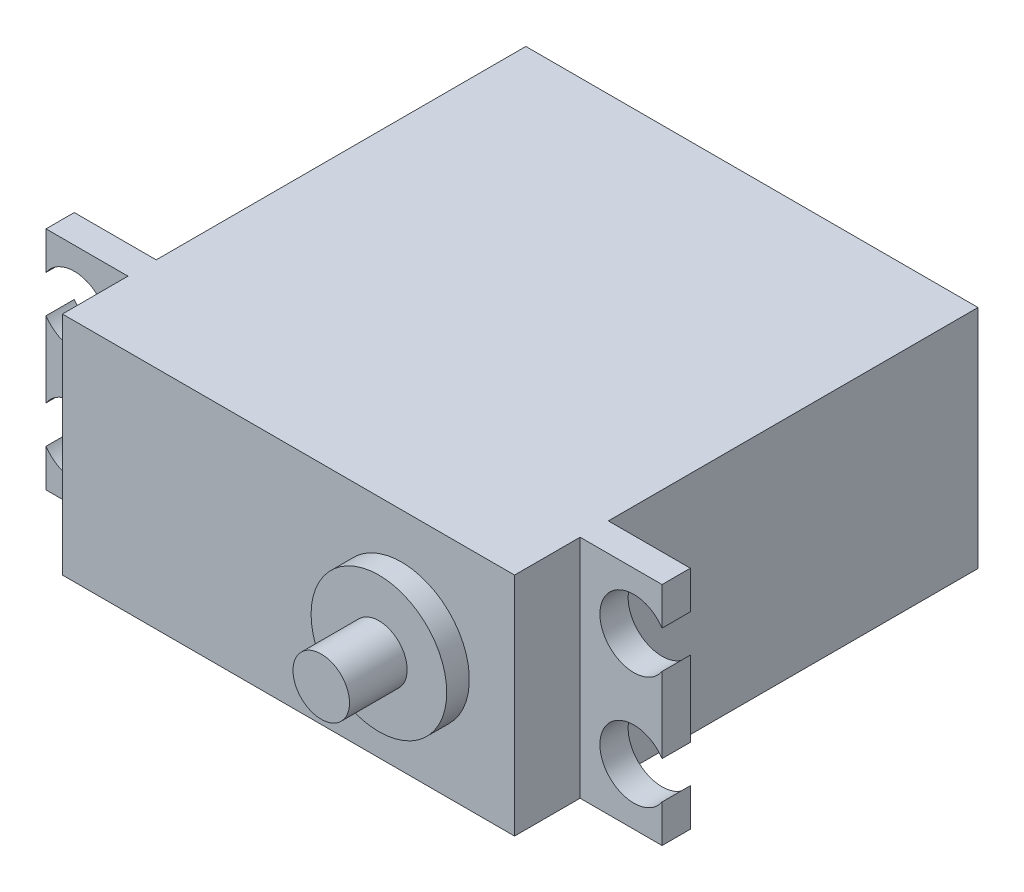
ISO-10303-21;
HEADER;
FILE_DESCRIPTION(('STEP AP214'),'2;1');
FILE_NAME('part.step','',(''),(''),'','','');
FILE_SCHEMA(('AUTOMOTIVE_DESIGN { 1 0 10303 214 1 1 1 1 }'));
ENDSEC;
DATA;
#1=APPLICATION_CONTEXT('core data for automotive mechanical design processes');
#2=APPLICATION_PROTOCOL_DEFINITION('international standard','automotive_design',2000,#1);
#3=PRODUCT_CONTEXT('',#1,'mechanical');
#4=PRODUCT('Part','Part','',(#3));
#5=PRODUCT_RELATED_PRODUCT_CATEGORY('part','',(#4));
#6=PRODUCT_DEFINITION_FORMATION('','',#4);
#7=PRODUCT_DEFINITION_CONTEXT('part definition',#1,'design');
#8=PRODUCT_DEFINITION('design','',#6,#7);
#9=PRODUCT_DEFINITION_SHAPE('','',#8);
#10=(LENGTH_UNIT() NAMED_UNIT(*) SI_UNIT(.MILLI.,.METRE.));
#11=(NAMED_UNIT(*) PLANE_ANGLE_UNIT() SI_UNIT($,.RADIAN.));
#12=(NAMED_UNIT(*) SI_UNIT($,.STERADIAN.) SOLID_ANGLE_UNIT());
#13=UNCERTAINTY_MEASURE_WITH_UNIT(LENGTH_MEASURE(1.E-05),#10,'distance_accuracy_value','');
#14=(GEOMETRIC_REPRESENTATION_CONTEXT(3) GLOBAL_UNCERTAINTY_ASSIGNED_CONTEXT((#13)) GLOBAL_UNIT_ASSIGNED_CONTEXT((#10,
#11,#12)) REPRESENTATION_CONTEXT('',''));
#15=CARTESIAN_POINT('',(0.,0.,0.));
#16=DIRECTION('',(0.,0.,1.));
#17=DIRECTION('',(1.,0.,0.));
#18=AXIS2_PLACEMENT_3D('',#15,#16,#17);
#19=CARTESIAN_POINT('',(47.25,20.,-8.3));
#20=DIRECTION('',(0.,0.,-1.));
#21=DIRECTION('',(0.,1.,0.));
#22=AXIS2_PLACEMENT_3D('',#19,#20,#21);
#23=PLANE('',#22);
#24=DIRECTION('',(0.,-1.,0.));
#25=VECTOR('',#24,1.);
#26=CARTESIAN_POINT('',(47.25,20.,-8.3));
#27=LINE('',#26,#25);
#28=CARTESIAN_POINT('',(47.25,13.3416876048223,-8.3));
#29=VERTEX_POINT('',#28);
#30=CARTESIAN_POINT('',(47.25,6.65831239517771,-8.3));
#31=VERTEX_POINT('',#30);
#32=EDGE_CURVE('E185',#29,#31,#27,.T.);
#33=ORIENTED_EDGE('',*,*,#32,.T.);
#34=CARTESIAN_POINT('',(44.75,5.,-8.3));
#35=DIRECTION('',(0.,0.,-1.));
#36=DIRECTION('',(0.,1.,0.));
#37=AXIS2_PLACEMENT_3D('',#34,#35,#36);
#38=CIRCLE('',#37,3.);
#39=CARTESIAN_POINT('',(47.25,3.34168760482229,-8.3));
#40=VERTEX_POINT('',#39);
#41=EDGE_CURVE('E171',#40,#31,#38,.T.);
#42=ORIENTED_EDGE('',*,*,#41,.F.);
#43=CARTESIAN_POINT('',(47.25,0.,-8.3));
#44=VERTEX_POINT('',#43);
#45=EDGE_CURVE('E191',#40,#44,#27,.T.);
#46=ORIENTED_EDGE('',*,*,#45,.T.);
#47=DIRECTION('',(-1.,0.,0.));
#48=VECTOR('',#47,1.);
#49=CARTESIAN_POINT('',(47.25,0.,-8.3));
#50=LINE('',#49,#48);
#51=CARTESIAN_POINT('',(40.,0.,-8.3));
#52=VERTEX_POINT('',#51);
#53=EDGE_CURVE('E207',#44,#52,#50,.T.);
#54=ORIENTED_EDGE('',*,*,#53,.T.);
#55=DIRECTION('',(0.,-1.,0.));
#56=VECTOR('',#55,1.);
#57=CARTESIAN_POINT('',(40.,20.,-8.3));
#58=LINE('',#57,#56);
#59=CARTESIAN_POINT('',(40.,20.,-8.3));
#60=VERTEX_POINT('',#59);
#61=EDGE_CURVE('E208',#60,#52,#58,.T.);
#62=ORIENTED_EDGE('',*,*,#61,.F.);
#63=DIRECTION('',(-1.,0.,0.));
#64=VECTOR('',#63,1.);
#65=CARTESIAN_POINT('',(47.25,20.,-8.3));
#66=LINE('',#65,#64);
#67=CARTESIAN_POINT('',(47.25,20.,-8.3));
#68=VERTEX_POINT('',#67);
#69=EDGE_CURVE('E218',#68,#60,#66,.T.);
#70=ORIENTED_EDGE('',*,*,#69,.F.);
#71=CARTESIAN_POINT('',(47.25,16.6583123951777,-8.3));
#72=VERTEX_POINT('',#71);
#73=EDGE_CURVE('E190',#68,#72,#27,.T.);
#74=ORIENTED_EDGE('',*,*,#73,.T.);
#75=CARTESIAN_POINT('',(44.75,15.,-8.3));
#76=DIRECTION('',(0.,0.,-1.));
#77=DIRECTION('',(0.,1.,0.));
#78=AXIS2_PLACEMENT_3D('',#75,#76,#77);
#79=CIRCLE('',#78,3.);
#80=EDGE_CURVE('E189',#29,#72,#79,.T.);
#81=ORIENTED_EDGE('',*,*,#80,.F.);
#82=EDGE_LOOP('',(#33,#42,#46,#54,#62,#70,#74,#81));
#83=FACE_BOUND('',#82,.T.);
#84=ADVANCED_FACE('F35',(#83),#23,.T.);
#85=CARTESIAN_POINT('',(47.25,20.,-5.8));
#86=DIRECTION('',(0.,0.,1.));
#87=DIRECTION('',(0.,-1.,0.));
#88=AXIS2_PLACEMENT_3D('',#85,#86,#87);
#89=PLANE('',#88);
#90=DIRECTION('',(0.,1.,0.));
#91=VECTOR('',#90,1.);
#92=CARTESIAN_POINT('',(47.25,20.,-5.8));
#93=LINE('',#92,#91);
#94=CARTESIAN_POINT('',(47.25,0.,-5.8));
#95=VERTEX_POINT('',#94);
#96=CARTESIAN_POINT('',(47.25,3.34168760482229,-5.8));
#97=VERTEX_POINT('',#96);
#98=EDGE_CURVE('E201',#95,#97,#93,.T.);
#99=ORIENTED_EDGE('',*,*,#98,.T.);
#100=CARTESIAN_POINT('',(44.75,5.,-5.8));
#101=DIRECTION('',(0.,0.,-1.));
#102=DIRECTION('',(-1.,0.,0.));
#103=AXIS2_PLACEMENT_3D('',#100,#101,#102);
#104=CIRCLE('',#103,3.);
#105=CARTESIAN_POINT('',(47.25,6.65831239517771,-5.8));
#106=VERTEX_POINT('',#105);
#107=EDGE_CURVE('E50',#97,#106,#104,.T.);
#108=ORIENTED_EDGE('',*,*,#107,.T.);
#109=CARTESIAN_POINT('',(47.25,13.3416876048223,-5.8));
#110=VERTEX_POINT('',#109);
#111=EDGE_CURVE('E57',#106,#110,#93,.T.);
#112=ORIENTED_EDGE('',*,*,#111,.T.);
#113=CARTESIAN_POINT('',(44.75,15.,-5.8));
#114=DIRECTION('',(0.,0.,-1.));
#115=DIRECTION('',(-1.,0.,0.));
#116=AXIS2_PLACEMENT_3D('',#113,#114,#115);
#117=CIRCLE('',#116,3.);
#118=CARTESIAN_POINT('',(47.25,16.6583123951777,-5.8));
#119=VERTEX_POINT('',#118);
#120=EDGE_CURVE('E374',#110,#119,#117,.T.);
#121=ORIENTED_EDGE('',*,*,#120,.T.);
#122=CARTESIAN_POINT('',(47.25,20.,-5.8));
#123=VERTEX_POINT('',#122);
#124=EDGE_CURVE('E200',#119,#123,#93,.T.);
#125=ORIENTED_EDGE('',*,*,#124,.T.);
#126=DIRECTION('',(-1.,0.,0.));
#127=VECTOR('',#126,1.);
#128=CARTESIAN_POINT('',(47.25,20.,-5.8));
#129=LINE('',#128,#127);
#130=CARTESIAN_POINT('',(40.,20.,-5.8));
#131=VERTEX_POINT('',#130);
#132=EDGE_CURVE('E216',#123,#131,#129,.T.);
#133=ORIENTED_EDGE('',*,*,#132,.T.);
#134=DIRECTION('',(0.,1.,0.));
#135=VECTOR('',#134,1.);
#136=CARTESIAN_POINT('',(40.,20.,-5.8));
#137=LINE('',#136,#135);
#138=CARTESIAN_POINT('',(40.,0.,-5.8));
#139=VERTEX_POINT('',#138);
#140=EDGE_CURVE('E194',#139,#131,#137,.T.);
#141=ORIENTED_EDGE('',*,*,#140,.F.);
#142=DIRECTION('',(-1.,0.,0.));
#143=VECTOR('',#142,1.);
#144=CARTESIAN_POINT('',(47.25,0.,-5.8));
#145=LINE('',#144,#143);
#146=EDGE_CURVE('E214',#95,#139,#145,.T.);
#147=ORIENTED_EDGE('',*,*,#146,.F.);
#148=EDGE_LOOP('',(#99,#108,#112,#121,#125,#133,#141,#147));
#149=FACE_BOUND('',#148,.T.);
#150=ADVANCED_FACE('F372',(#149),#89,.T.);
#151=CARTESIAN_POINT('',(47.25,0.,0.));
#152=DIRECTION('',(1.,0.,0.));
#153=DIRECTION('',(0.,0.,1.));
#154=AXIS2_PLACEMENT_3D('',#151,#152,#153);
#155=PLANE('',#154);
#156=ORIENTED_EDGE('',*,*,#111,.F.);
#157=DIRECTION('',(0.,0.,1.));
#158=VECTOR('',#157,1.);
#159=CARTESIAN_POINT('',(47.25,6.65831239517771,-41.001));
#160=LINE('',#159,#158);
#161=EDGE_CURVE('E174',#31,#106,#160,.T.);
#162=ORIENTED_EDGE('',*,*,#161,.F.);
#163=ORIENTED_EDGE('',*,*,#32,.F.);
#164=DIRECTION('',(0.,0.,1.));
#165=VECTOR('',#164,1.);
#166=CARTESIAN_POINT('',(47.25,13.3416876048223,-41.001));
#167=LINE('',#166,#165);
#168=EDGE_CURVE('E179',#110,#29,#167,.F.);
#169=ORIENTED_EDGE('',*,*,#168,.F.);
#170=EDGE_LOOP('',(#156,#162,#163,#169));
#171=FACE_BOUND('',#170,.T.);
#172=ADVANCED_FACE('F183',(#171),#155,.T.);
#173=ORIENTED_EDGE('',*,*,#45,.F.);
#174=DIRECTION('',(0.,0.,1.));
#175=VECTOR('',#174,1.);
#176=CARTESIAN_POINT('',(47.25,3.34168760482229,-41.001));
#177=LINE('',#176,#175);
#178=EDGE_CURVE('E175',#97,#40,#177,.F.);
#179=ORIENTED_EDGE('',*,*,#178,.F.);
#180=ORIENTED_EDGE('',*,*,#98,.F.);
#181=DIRECTION('',(0.,0.,1.));
#182=VECTOR('',#181,1.);
#183=CARTESIAN_POINT('',(47.25,0.,-8.3));
#184=LINE('',#183,#182);
#185=EDGE_CURVE('E204',#44,#95,#184,.T.);
#186=ORIENTED_EDGE('',*,*,#185,.F.);
#187=EDGE_LOOP('',(#173,#179,#180,#186));
#188=FACE_BOUND('',#187,.T.);
#189=ADVANCED_FACE('F370',(#188),#155,.T.);
#190=ORIENTED_EDGE('',*,*,#124,.F.);
#191=DIRECTION('',(0.,0.,1.));
#192=VECTOR('',#191,1.);
#193=CARTESIAN_POINT('',(47.25,16.6583123951777,-41.001));
#194=LINE('',#193,#192);
#195=EDGE_CURVE('E378',#72,#119,#194,.T.);
#196=ORIENTED_EDGE('',*,*,#195,.F.);
#197=ORIENTED_EDGE('',*,*,#73,.F.);
#198=DIRECTION('',(0.,0.,-1.));
#199=VECTOR('',#198,1.);
#200=CARTESIAN_POINT('',(47.25,20.,-8.3));
#201=LINE('',#200,#199);
#202=EDGE_CURVE('E193',#123,#68,#201,.T.);
#203=ORIENTED_EDGE('',*,*,#202,.F.);
#204=EDGE_LOOP('',(#190,#196,#197,#203));
#205=FACE_BOUND('',#204,.T.);
#206=ADVANCED_FACE('F377',(#205),#155,.T.);
#207=CARTESIAN_POINT('',(40.,20.,0.));
#208=DIRECTION('',(-1.,0.,0.));
#209=DIRECTION('',(0.,0.,1.));
#210=AXIS2_PLACEMENT_3D('',#207,#208,#209);
#211=PLANE('',#210);
#212=DIRECTION('',(0.,0.,-1.));
#213=VECTOR('',#212,1.);
#214=CARTESIAN_POINT('',(40.,20.,0.));
#215=LINE('',#214,#213);
#216=CARTESIAN_POINT('',(40.,20.,-41.));
#217=VERTEX_POINT('',#216);
#218=EDGE_CURVE('E288',#60,#217,#215,.T.);
#219=ORIENTED_EDGE('',*,*,#218,.F.);
#220=ORIENTED_EDGE('',*,*,#61,.T.);
#221=DIRECTION('',(0.,0.,-1.));
#222=VECTOR('',#221,1.);
#223=CARTESIAN_POINT('',(40.,0.,0.));
#224=LINE('',#223,#222);
#225=CARTESIAN_POINT('',(40.,0.,-41.));
#226=VERTEX_POINT('',#225);
#227=EDGE_CURVE('E299',#52,#226,#224,.T.);
#228=ORIENTED_EDGE('',*,*,#227,.T.);
#229=DIRECTION('',(0.,-1.,0.));
#230=VECTOR('',#229,1.);
#231=CARTESIAN_POINT('',(40.,20.,-41.));
#232=LINE('',#231,#230);
#233=EDGE_CURVE('E307',#217,#226,#232,.T.);
#234=ORIENTED_EDGE('',*,*,#233,.F.);
#235=EDGE_LOOP('',(#219,#220,#228,#234));
#236=FACE_BOUND('',#235,.T.);
#237=ADVANCED_FACE('F366',(#236),#211,.F.);
#238=CARTESIAN_POINT('',(-7.25,0.,0.));
#239=DIRECTION('',(-1.,0.,0.));
#240=DIRECTION('',(0.,0.,1.));
#241=AXIS2_PLACEMENT_3D('',#238,#239,#240);
#242=PLANE('',#241);
#243=DIRECTION('',(0.,0.,1.));
#244=VECTOR('',#243,1.);
#245=CARTESIAN_POINT('',(-7.25,3.34168760482229,-41.001));
#246=LINE('',#245,#244);
#247=CARTESIAN_POINT('',(-7.25,3.34168760482229,-5.8));
#248=VERTEX_POINT('',#247);
#249=CARTESIAN_POINT('',(-7.25,3.34168760482229,-8.3));
#250=VERTEX_POINT('',#249);
#251=EDGE_CURVE('E223',#248,#250,#246,.F.);
#252=ORIENTED_EDGE('',*,*,#251,.T.);
#253=DIRECTION('',(0.,-1.,0.));
#254=VECTOR('',#253,1.);
#255=CARTESIAN_POINT('',(-7.25,20.,-8.3));
#256=LINE('',#255,#254);
#257=CARTESIAN_POINT('',(-7.25,0.,-8.3));
#258=VERTEX_POINT('',#257);
#259=EDGE_CURVE('E246',#250,#258,#256,.T.);
#260=ORIENTED_EDGE('',*,*,#259,.T.);
#261=DIRECTION('',(0.,0.,1.));
#262=VECTOR('',#261,1.);
#263=CARTESIAN_POINT('',(-7.25,0.,-8.3));
#264=LINE('',#263,#262);
#265=CARTESIAN_POINT('',(-7.25,0.,-5.8));
#266=VERTEX_POINT('',#265);
#267=EDGE_CURVE('E244',#258,#266,#264,.T.);
#268=ORIENTED_EDGE('',*,*,#267,.T.);
#269=DIRECTION('',(0.,1.,0.));
#270=VECTOR('',#269,1.);
#271=CARTESIAN_POINT('',(-7.25,20.,-5.8));
#272=LINE('',#271,#270);
#273=EDGE_CURVE('E249',#266,#248,#272,.T.);
#274=ORIENTED_EDGE('',*,*,#273,.T.);
#275=EDGE_LOOP('',(#252,#260,#268,#274));
#276=FACE_BOUND('',#275,.T.);
#277=ADVANCED_FACE('F411',(#276),#242,.T.);
#278=DIRECTION('',(0.,0.,1.));
#279=VECTOR('',#278,1.);
#280=CARTESIAN_POINT('',(-7.25,6.6583123951777,-41.001));
#281=LINE('',#280,#279);
#282=CARTESIAN_POINT('',(-7.25,6.6583123951777,-8.3));
#283=VERTEX_POINT('',#282);
#284=CARTESIAN_POINT('',(-7.25,6.6583123951777,-5.8));
#285=VERTEX_POINT('',#284);
#286=EDGE_CURVE('E220',#283,#285,#281,.T.);
#287=ORIENTED_EDGE('',*,*,#286,.T.);
#288=CARTESIAN_POINT('',(-7.25,13.3416876048223,-5.8));
#289=VERTEX_POINT('',#288);
#290=EDGE_CURVE('E253',#285,#289,#272,.T.);
#291=ORIENTED_EDGE('',*,*,#290,.T.);
#292=DIRECTION('',(0.,0.,1.));
#293=VECTOR('',#292,1.);
#294=CARTESIAN_POINT('',(-7.25,13.3416876048223,-41.001));
#295=LINE('',#294,#293);
#296=CARTESIAN_POINT('',(-7.25,13.3416876048223,-8.3));
#297=VERTEX_POINT('',#296);
#298=EDGE_CURVE('E233',#289,#297,#295,.F.);
#299=ORIENTED_EDGE('',*,*,#298,.T.);
#300=EDGE_CURVE('E245',#297,#283,#256,.T.);
#301=ORIENTED_EDGE('',*,*,#300,.T.);
#302=EDGE_LOOP('',(#287,#291,#299,#301));
#303=FACE_BOUND('',#302,.T.);
#304=ADVANCED_FACE('F412',(#303),#242,.T.);
#305=CARTESIAN_POINT('',(0.,20.,0.));
#306=DIRECTION('',(1.,0.,0.));
#307=DIRECTION('',(0.,0.,-1.));
#308=AXIS2_PLACEMENT_3D('',#305,#306,#307);
#309=PLANE('',#308);
#310=DIRECTION('',(0.,-1.,0.));
#311=VECTOR('',#310,1.);
#312=CARTESIAN_POINT('',(0.,20.,-8.3));
#313=LINE('',#312,#311);
#314=CARTESIAN_POINT('',(0.,20.,-8.3));
#315=VERTEX_POINT('',#314);
#316=CARTESIAN_POINT('',(0.,0.,-8.3));
#317=VERTEX_POINT('',#316);
#318=EDGE_CURVE('E240',#315,#317,#313,.T.);
#319=ORIENTED_EDGE('',*,*,#318,.F.);
#320=DIRECTION('',(0.,0.,1.));
#321=VECTOR('',#320,1.);
#322=CARTESIAN_POINT('',(0.,20.,0.));
#323=LINE('',#322,#321);
#324=CARTESIAN_POINT('',(0.,20.,-41.));
#325=VERTEX_POINT('',#324);
#326=EDGE_CURVE('E282',#325,#315,#323,.T.);
#327=ORIENTED_EDGE('',*,*,#326,.F.);
#328=DIRECTION('',(0.,-1.,0.));
#329=VECTOR('',#328,1.);
#330=CARTESIAN_POINT('',(0.,20.,-41.));
#331=LINE('',#330,#329);
#332=CARTESIAN_POINT('',(0.,0.,-41.));
#333=VERTEX_POINT('',#332);
#334=EDGE_CURVE('E294',#325,#333,#331,.T.);
#335=ORIENTED_EDGE('',*,*,#334,.T.);
#336=DIRECTION('',(0.,0.,1.));
#337=VECTOR('',#336,1.);
#338=CARTESIAN_POINT('',(0.,0.,0.));
#339=LINE('',#338,#337);
#340=EDGE_CURVE('E295',#333,#317,#339,.T.);
#341=ORIENTED_EDGE('',*,*,#340,.T.);
#342=EDGE_LOOP('',(#319,#327,#335,#341));
#343=FACE_BOUND('',#342,.T.);
#344=ADVANCED_FACE('F37',(#343),#309,.F.);
#345=DIRECTION('',(0.,1.,0.));
#346=VECTOR('',#345,1.);
#347=CARTESIAN_POINT('',(0.,20.,-5.8));
#348=LINE('',#347,#346);
#349=CARTESIAN_POINT('',(0.,0.,-5.8));
#350=VERTEX_POINT('',#349);
#351=CARTESIAN_POINT('',(0.,20.,-5.8));
#352=VERTEX_POINT('',#351);
#353=EDGE_CURVE('E258',#350,#352,#348,.T.);
#354=ORIENTED_EDGE('',*,*,#353,.F.);
#355=CARTESIAN_POINT('',(0.,0.,0.));
#356=VERTEX_POINT('',#355);
#357=EDGE_CURVE('E281',#350,#356,#339,.T.);
#358=ORIENTED_EDGE('',*,*,#357,.T.);
#359=DIRECTION('',(0.,-1.,0.));
#360=VECTOR('',#359,1.);
#361=CARTESIAN_POINT('',(0.,20.,0.));
#362=LINE('',#361,#360);
#363=CARTESIAN_POINT('',(0.,20.,0.));
#364=VERTEX_POINT('',#363);
#365=EDGE_CURVE('E43',#364,#356,#362,.T.);
#366=ORIENTED_EDGE('',*,*,#365,.F.);
#367=EDGE_CURVE('E286',#352,#364,#323,.T.);
#368=ORIENTED_EDGE('',*,*,#367,.F.);
#369=EDGE_LOOP('',(#354,#358,#366,#368));
#370=FACE_BOUND('',#369,.T.);
#371=ADVANCED_FACE('F320',(#370),#309,.F.);
#372=CARTESIAN_POINT('',(0.,20.,0.));
#373=DIRECTION('',(0.,0.,-1.));
#374=DIRECTION('',(-1.,0.,0.));
#375=AXIS2_PLACEMENT_3D('',#372,#373,#374);
#376=PLANE('',#375);
#377=CARTESIAN_POINT('',(30.,10.,0.));
#378=DIRECTION('',(0.,0.,-1.));
#379=DIRECTION('',(-1.,0.,0.));
#380=AXIS2_PLACEMENT_3D('',#377,#378,#379);
#381=CIRCLE('',#380,6.);
#382=CARTESIAN_POINT('',(24.,10.,0.));
#383=VERTEX_POINT('',#382);
#384=EDGE_CURVE('E11',#383,#383,#381,.F.);
#385=ORIENTED_EDGE('',*,*,#384,.F.);
#386=EDGE_LOOP('',(#385));
#387=FACE_BOUND('',#386,.T.);
#388=DIRECTION('',(1.,0.,0.));
#389=VECTOR('',#388,1.);
#390=CARTESIAN_POINT('',(0.,0.,0.));
#391=LINE('',#390,#389);
#392=CARTESIAN_POINT('',(40.,0.,0.));
#393=VERTEX_POINT('',#392);
#394=EDGE_CURVE('E297',#356,#393,#391,.T.);
#395=ORIENTED_EDGE('',*,*,#394,.T.);
#396=DIRECTION('',(0.,-1.,0.));
#397=VECTOR('',#396,1.);
#398=CARTESIAN_POINT('',(40.,20.,0.));
#399=LINE('',#398,#397);
#400=CARTESIAN_POINT('',(40.,20.,0.));
#401=VERTEX_POINT('',#400);
#402=EDGE_CURVE('E310',#401,#393,#399,.T.);
#403=ORIENTED_EDGE('',*,*,#402,.F.);
#404=DIRECTION('',(1.,0.,0.));
#405=VECTOR('',#404,1.);
#406=CARTESIAN_POINT('',(0.,20.,0.));
#407=LINE('',#406,#405);
#408=EDGE_CURVE('E285',#364,#401,#407,.T.);
#409=ORIENTED_EDGE('',*,*,#408,.F.);
#410=ORIENTED_EDGE('',*,*,#365,.T.);
#411=EDGE_LOOP('',(#395,#403,#409,#410));
#412=FACE_BOUND('',#411,.T.);
#413=ADVANCED_FACE('F316',(#387,#412),#376,.F.);
#414=EDGE_CURVE('E300',#393,#139,#224,.T.);
#415=ORIENTED_EDGE('',*,*,#414,.T.);
#416=ORIENTED_EDGE('',*,*,#140,.T.);
#417=EDGE_CURVE('E289',#401,#131,#215,.T.);
#418=ORIENTED_EDGE('',*,*,#417,.F.);
#419=ORIENTED_EDGE('',*,*,#402,.T.);
#420=EDGE_LOOP('',(#415,#416,#418,#419));
#421=FACE_BOUND('',#420,.T.);
#422=ADVANCED_FACE('F329',(#421),#211,.F.);
#423=CARTESIAN_POINT('',(0.,20.,-41.));
#424=DIRECTION('',(0.,0.,1.));
#425=DIRECTION('',(1.,0.,0.));
#426=AXIS2_PLACEMENT_3D('',#423,#424,#425);
#427=PLANE('',#426);
#428=DIRECTION('',(-1.,0.,0.));
#429=VECTOR('',#428,1.);
#430=CARTESIAN_POINT('',(0.,0.,-41.));
#431=LINE('',#430,#429);
#432=EDGE_CURVE('E303',#226,#333,#431,.T.);
#433=ORIENTED_EDGE('',*,*,#432,.T.);
#434=ORIENTED_EDGE('',*,*,#334,.F.);
#435=DIRECTION('',(-1.,0.,0.));
#436=VECTOR('',#435,1.);
#437=CARTESIAN_POINT('',(0.,20.,-41.));
#438=LINE('',#437,#436);
#439=EDGE_CURVE('E292',#217,#325,#438,.T.);
#440=ORIENTED_EDGE('',*,*,#439,.F.);
#441=ORIENTED_EDGE('',*,*,#233,.T.);
#442=EDGE_LOOP('',(#433,#434,#440,#441));
#443=FACE_BOUND('',#442,.T.);
#444=ADVANCED_FACE('F360',(#443),#427,.F.);
#445=CARTESIAN_POINT('',(0.,20.,0.));
#446=DIRECTION('',(0.,-1.,0.));
#447=DIRECTION('',(0.,0.,-1.));
#448=AXIS2_PLACEMENT_3D('',#445,#446,#447);
#449=PLANE('',#448);
#450=ORIENTED_EDGE('',*,*,#326,.T.);
#451=DIRECTION('',(1.,0.,0.));
#452=VECTOR('',#451,1.);
#453=CARTESIAN_POINT('',(-7.25,20.,-8.3));
#454=LINE('',#453,#452);
#455=CARTESIAN_POINT('',(-7.25,20.,-8.3));
#456=VERTEX_POINT('',#455);
#457=EDGE_CURVE('E255',#456,#315,#454,.T.);
#458=ORIENTED_EDGE('',*,*,#457,.F.);
#459=DIRECTION('',(0.,0.,-1.));
#460=VECTOR('',#459,1.);
#461=CARTESIAN_POINT('',(-7.25,20.,-8.3));
#462=LINE('',#461,#460);
#463=CARTESIAN_POINT('',(-7.25,20.,-5.8));
#464=VERTEX_POINT('',#463);
#465=EDGE_CURVE('E252',#464,#456,#462,.T.);
#466=ORIENTED_EDGE('',*,*,#465,.F.);
#467=DIRECTION('',(1.,0.,0.));
#468=VECTOR('',#467,1.);
#469=CARTESIAN_POINT('',(-7.25,20.,-5.8));
#470=LINE('',#469,#468);
#471=EDGE_CURVE('E263',#464,#352,#470,.T.);
#472=ORIENTED_EDGE('',*,*,#471,.T.);
#473=ORIENTED_EDGE('',*,*,#367,.T.);
#474=ORIENTED_EDGE('',*,*,#408,.T.);
#475=ORIENTED_EDGE('',*,*,#417,.T.);
#476=ORIENTED_EDGE('',*,*,#132,.F.);
#477=ORIENTED_EDGE('',*,*,#202,.T.);
#478=ORIENTED_EDGE('',*,*,#69,.T.);
#479=ORIENTED_EDGE('',*,*,#218,.T.);
#480=ORIENTED_EDGE('',*,*,#439,.T.);
#481=EDGE_LOOP('',(#450,#458,#466,#472,#473,#474,#475,#476,#477,#478,#479,#480));
#482=FACE_BOUND('',#481,.T.);
#483=ADVANCED_FACE('F333',(#482),#449,.F.);
#484=CARTESIAN_POINT('',(0.,0.,0.));
#485=DIRECTION('',(0.,-1.,0.));
#486=DIRECTION('',(0.,0.,-1.));
#487=AXIS2_PLACEMENT_3D('',#484,#485,#486);
#488=PLANE('',#487);
#489=ORIENTED_EDGE('',*,*,#340,.F.);
#490=ORIENTED_EDGE('',*,*,#432,.F.);
#491=ORIENTED_EDGE('',*,*,#227,.F.);
#492=ORIENTED_EDGE('',*,*,#53,.F.);
#493=ORIENTED_EDGE('',*,*,#185,.T.);
#494=ORIENTED_EDGE('',*,*,#146,.T.);
#495=ORIENTED_EDGE('',*,*,#414,.F.);
#496=ORIENTED_EDGE('',*,*,#394,.F.);
#497=ORIENTED_EDGE('',*,*,#357,.F.);
#498=DIRECTION('',(1.,0.,0.));
#499=VECTOR('',#498,1.);
#500=CARTESIAN_POINT('',(-7.25,0.,-5.8));
#501=LINE('',#500,#499);
#502=EDGE_CURVE('E266',#266,#350,#501,.T.);
#503=ORIENTED_EDGE('',*,*,#502,.F.);
#504=ORIENTED_EDGE('',*,*,#267,.F.);
#505=DIRECTION('',(1.,0.,0.));
#506=VECTOR('',#505,1.);
#507=CARTESIAN_POINT('',(-7.25,0.,-8.3));
#508=LINE('',#507,#506);
#509=EDGE_CURVE('E269',#258,#317,#508,.T.);
#510=ORIENTED_EDGE('',*,*,#509,.T.);
#511=EDGE_LOOP('',(#489,#490,#491,#492,#493,#494,#495,#496,#497,#503,#504,#510));
#512=FACE_BOUND('',#511,.T.);
#513=ADVANCED_FACE('F326',(#512),#488,.T.);
#514=CARTESIAN_POINT('',(30.,10.,2.));
#515=DIRECTION('',(0.,0.,-1.));
#516=DIRECTION('',(-1.,0.,0.));
#517=AXIS2_PLACEMENT_3D('',#514,#515,#516);
#518=CYLINDRICAL_SURFACE('',#517,6.);
#519=CARTESIAN_POINT('',(30.,10.,2.));
#520=DIRECTION('',(0.,0.,1.));
#521=DIRECTION('',(1.,0.,0.));
#522=AXIS2_PLACEMENT_3D('',#519,#520,#521);
#523=CIRCLE('',#522,6.);
#524=CARTESIAN_POINT('',(36.,10.,2.));
#525=VERTEX_POINT('',#524);
#526=EDGE_CURVE('E276',#525,#525,#523,.T.);
#527=ORIENTED_EDGE('',*,*,#526,.F.);
#528=EDGE_LOOP('',(#527));
#529=FACE_BOUND('',#528,.T.);
#530=ORIENTED_EDGE('',*,*,#384,.T.);
#531=EDGE_LOOP('',(#530));
#532=FACE_BOUND('',#531,.T.);
#533=ADVANCED_FACE('F428',(#529,#532),#518,.T.);
#534=CARTESIAN_POINT('',(30.,10.,2.));
#535=DIRECTION('',(0.,0.,1.));
#536=DIRECTION('',(1.,0.,0.));
#537=AXIS2_PLACEMENT_3D('',#534,#535,#536);
#538=PLANE('',#537);
#539=CARTESIAN_POINT('',(30.,10.,2.));
#540=DIRECTION('',(0.,0.,1.));
#541=DIRECTION('',(1.,0.,0.));
#542=AXIS2_PLACEMENT_3D('',#539,#540,#541);
#543=CIRCLE('',#542,2.5);
#544=CARTESIAN_POINT('',(32.5,10.,2.));
#545=VERTEX_POINT('',#544);
#546=EDGE_CURVE('E272',#545,#545,#543,.T.);
#547=ORIENTED_EDGE('',*,*,#546,.F.);
#548=EDGE_LOOP('',(#547));
#549=FACE_BOUND('',#548,.T.);
#550=ORIENTED_EDGE('',*,*,#526,.T.);
#551=EDGE_LOOP('',(#550));
#552=FACE_BOUND('',#551,.T.);
#553=ADVANCED_FACE('F424',(#549,#552),#538,.T.);
#554=CARTESIAN_POINT('',(30.,10.,7.1));
#555=DIRECTION('',(0.,0.,-1.));
#556=DIRECTION('',(-1.,0.,0.));
#557=AXIS2_PLACEMENT_3D('',#554,#555,#556);
#558=CYLINDRICAL_SURFACE('',#557,2.5);
#559=CARTESIAN_POINT('',(30.,10.,7.1));
#560=DIRECTION('',(0.,0.,1.));
#561=DIRECTION('',(1.,0.,0.));
#562=AXIS2_PLACEMENT_3D('',#559,#560,#561);
#563=CIRCLE('',#562,2.5);
#564=CARTESIAN_POINT('',(32.5,10.,7.1));
#565=VERTEX_POINT('',#564);
#566=EDGE_CURVE('E273',#565,#565,#563,.T.);
#567=ORIENTED_EDGE('',*,*,#566,.F.);
#568=EDGE_LOOP('',(#567));
#569=FACE_BOUND('',#568,.T.);
#570=ORIENTED_EDGE('',*,*,#546,.T.);
#571=EDGE_LOOP('',(#570));
#572=FACE_BOUND('',#571,.T.);
#573=ADVANCED_FACE('F420',(#569,#572),#558,.T.);
#574=CARTESIAN_POINT('',(30.,10.,7.1));
#575=DIRECTION('',(0.,0.,1.));
#576=DIRECTION('',(1.,0.,0.));
#577=AXIS2_PLACEMENT_3D('',#574,#575,#576);
#578=PLANE('',#577);
#579=ORIENTED_EDGE('',*,*,#566,.T.);
#580=EDGE_LOOP('',(#579));
#581=FACE_BOUND('',#580,.T.);
#582=ADVANCED_FACE('F417',(#581),#578,.T.);
#583=CARTESIAN_POINT('',(-7.25,20.,-8.3));
#584=DIRECTION('',(0.,0.,1.));
#585=DIRECTION('',(0.,-1.,0.));
#586=AXIS2_PLACEMENT_3D('',#583,#584,#585);
#587=PLANE('',#586);
#588=ORIENTED_EDGE('',*,*,#259,.F.);
#589=CARTESIAN_POINT('',(-4.75,5.,-8.3));
#590=DIRECTION('',(0.,0.,1.));
#591=DIRECTION('',(0.,-1.,0.));
#592=AXIS2_PLACEMENT_3D('',#589,#590,#591);
#593=CIRCLE('',#592,3.);
#594=EDGE_CURVE('E228',#283,#250,#593,.F.);
#595=ORIENTED_EDGE('',*,*,#594,.F.);
#596=ORIENTED_EDGE('',*,*,#300,.F.);
#597=CARTESIAN_POINT('',(-4.75,15.,-8.3));
#598=DIRECTION('',(0.,0.,1.));
#599=DIRECTION('',(0.,-1.,0.));
#600=AXIS2_PLACEMENT_3D('',#597,#598,#599);
#601=CIRCLE('',#600,3.);
#602=CARTESIAN_POINT('',(-7.25,16.6583123951777,-8.3));
#603=VERTEX_POINT('',#602);
#604=EDGE_CURVE('E238',#603,#297,#601,.F.);
#605=ORIENTED_EDGE('',*,*,#604,.F.);
#606=EDGE_CURVE('E241',#456,#603,#256,.T.);
#607=ORIENTED_EDGE('',*,*,#606,.F.);
#608=ORIENTED_EDGE('',*,*,#457,.T.);
#609=ORIENTED_EDGE('',*,*,#318,.T.);
#610=ORIENTED_EDGE('',*,*,#509,.F.);
#611=EDGE_LOOP('',(#588,#595,#596,#605,#607,#608,#609,#610));
#612=FACE_BOUND('',#611,.T.);
#613=ADVANCED_FACE('F350',(#612),#587,.F.);
#614=CARTESIAN_POINT('',(-7.25,20.,-5.8));
#615=DIRECTION('',(0.,0.,-1.));
#616=DIRECTION('',(0.,1.,0.));
#617=AXIS2_PLACEMENT_3D('',#614,#615,#616);
#618=PLANE('',#617);
#619=ORIENTED_EDGE('',*,*,#290,.F.);
#620=CARTESIAN_POINT('',(-4.75,5.,-5.8));
#621=DIRECTION('',(0.,0.,1.));
#622=DIRECTION('',(1.,0.,0.));
#623=AXIS2_PLACEMENT_3D('',#620,#621,#622);
#624=CIRCLE('',#623,3.);
#625=EDGE_CURVE('E226',#248,#285,#624,.T.);
#626=ORIENTED_EDGE('',*,*,#625,.F.);
#627=ORIENTED_EDGE('',*,*,#273,.F.);
#628=ORIENTED_EDGE('',*,*,#502,.T.);
#629=ORIENTED_EDGE('',*,*,#353,.T.);
#630=ORIENTED_EDGE('',*,*,#471,.F.);
#631=CARTESIAN_POINT('',(-7.25,16.6583123951777,-5.8));
#632=VERTEX_POINT('',#631);
#633=EDGE_CURVE('E248',#632,#464,#272,.T.);
#634=ORIENTED_EDGE('',*,*,#633,.F.);
#635=CARTESIAN_POINT('',(-4.75,15.,-5.8));
#636=DIRECTION('',(0.,0.,1.));
#637=DIRECTION('',(1.,0.,0.));
#638=AXIS2_PLACEMENT_3D('',#635,#636,#637);
#639=CIRCLE('',#638,3.);
#640=EDGE_CURVE('E236',#289,#632,#639,.T.);
#641=ORIENTED_EDGE('',*,*,#640,.F.);
#642=EDGE_LOOP('',(#619,#626,#627,#628,#629,#630,#634,#641));
#643=FACE_BOUND('',#642,.T.);
#644=ADVANCED_FACE('F341',(#643),#618,.F.);
#645=DIRECTION('',(0.,0.,1.));
#646=VECTOR('',#645,1.);
#647=CARTESIAN_POINT('',(-7.25,16.6583123951777,-41.001));
#648=LINE('',#647,#646);
#649=EDGE_CURVE('E230',#603,#632,#648,.T.);
#650=ORIENTED_EDGE('',*,*,#649,.T.);
#651=ORIENTED_EDGE('',*,*,#633,.T.);
#652=ORIENTED_EDGE('',*,*,#465,.T.);
#653=ORIENTED_EDGE('',*,*,#606,.T.);
#654=EDGE_LOOP('',(#650,#651,#652,#653));
#655=FACE_BOUND('',#654,.T.);
#656=ADVANCED_FACE('F406',(#655),#242,.T.);
#657=CARTESIAN_POINT('',(-4.75,15.,-41.001));
#658=DIRECTION('',(0.,0.,1.));
#659=DIRECTION('',(1.,0.,0.));
#660=AXIS2_PLACEMENT_3D('',#657,#658,#659);
#661=CYLINDRICAL_SURFACE('',#660,3.);
#662=ORIENTED_EDGE('',*,*,#640,.T.);
#663=ORIENTED_EDGE('',*,*,#649,.F.);
#664=ORIENTED_EDGE('',*,*,#604,.T.);
#665=ORIENTED_EDGE('',*,*,#298,.F.);
#666=EDGE_LOOP('',(#662,#663,#664,#665));
#667=FACE_BOUND('',#666,.T.);
#668=ADVANCED_FACE('F393',(#667),#661,.F.);
#669=CARTESIAN_POINT('',(-4.75,5.,-41.001));
#670=DIRECTION('',(0.,0.,1.));
#671=DIRECTION('',(1.,0.,0.));
#672=AXIS2_PLACEMENT_3D('',#669,#670,#671);
#673=CYLINDRICAL_SURFACE('',#672,3.);
#674=ORIENTED_EDGE('',*,*,#625,.T.);
#675=ORIENTED_EDGE('',*,*,#286,.F.);
#676=ORIENTED_EDGE('',*,*,#594,.T.);
#677=ORIENTED_EDGE('',*,*,#251,.F.);
#678=EDGE_LOOP('',(#674,#675,#676,#677));
#679=FACE_BOUND('',#678,.T.);
#680=ADVANCED_FACE('F386',(#679),#673,.F.);
#681=CARTESIAN_POINT('',(44.75,15.,-41.001));
#682=DIRECTION('',(0.,0.,1.));
#683=DIRECTION('',(1.,0.,0.));
#684=AXIS2_PLACEMENT_3D('',#681,#682,#683);
#685=CYLINDRICAL_SURFACE('',#684,3.);
#686=ORIENTED_EDGE('',*,*,#195,.T.);
#687=ORIENTED_EDGE('',*,*,#120,.F.);
#688=ORIENTED_EDGE('',*,*,#168,.T.);
#689=ORIENTED_EDGE('',*,*,#80,.T.);
#690=EDGE_LOOP('',(#686,#687,#688,#689));
#691=FACE_BOUND('',#690,.T.);
#692=ADVANCED_FACE('F384',(#691),#685,.F.);
#693=CARTESIAN_POINT('',(44.75,5.,-41.001));
#694=DIRECTION('',(0.,0.,1.));
#695=DIRECTION('',(1.,0.,0.));
#696=AXIS2_PLACEMENT_3D('',#693,#694,#695);
#697=CYLINDRICAL_SURFACE('',#696,3.);
#698=ORIENTED_EDGE('',*,*,#161,.T.);
#699=ORIENTED_EDGE('',*,*,#107,.F.);
#700=ORIENTED_EDGE('',*,*,#178,.T.);
#701=ORIENTED_EDGE('',*,*,#41,.T.);
#702=EDGE_LOOP('',(#698,#699,#700,#701));
#703=FACE_BOUND('',#702,.T.);
#704=ADVANCED_FACE('F173',(#703),#697,.F.);
#705=CLOSED_SHELL('',(#84,#150,#172,#189,#206,#237,#277,#304,#344,#371,#413,#422,#444,#483,#513,
#533,#553,#573,#582,#613,#644,#656,#668,#680,#692,#704));
#706=MANIFOLD_SOLID_BREP('B2',#705);
#707=ADVANCED_BREP_SHAPE_REPRESENTATION('',(#18,#706),#14);
#708=SHAPE_DEFINITION_REPRESENTATION(#9,#707);
ENDSEC;
END-ISO-10303-21;
